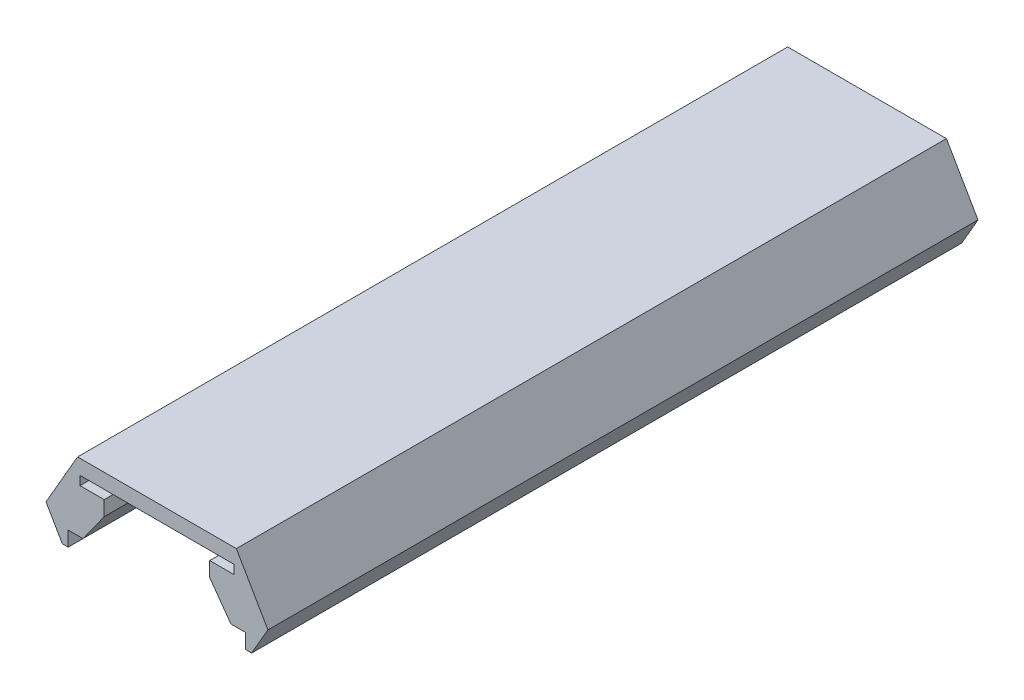
ISO-10303-21;
HEADER;
FILE_DESCRIPTION(('STEP AP214'),'2;1');
FILE_NAME('part.step','',(''),(''),'','','');
FILE_SCHEMA(('AUTOMOTIVE_DESIGN { 1 0 10303 214 1 1 1 1 }'));
ENDSEC;
DATA;
#1=APPLICATION_CONTEXT('core data for automotive mechanical design processes');
#2=APPLICATION_PROTOCOL_DEFINITION('international standard','automotive_design',2000,#1);
#3=PRODUCT_CONTEXT('',#1,'mechanical');
#4=PRODUCT('Part','Part','',(#3));
#5=PRODUCT_RELATED_PRODUCT_CATEGORY('part','',(#4));
#6=PRODUCT_DEFINITION_FORMATION('','',#4);
#7=PRODUCT_DEFINITION_CONTEXT('part definition',#1,'design');
#8=PRODUCT_DEFINITION('design','',#6,#7);
#9=PRODUCT_DEFINITION_SHAPE('','',#8);
#10=(LENGTH_UNIT() NAMED_UNIT(*) SI_UNIT(.MILLI.,.METRE.));
#11=(NAMED_UNIT(*) PLANE_ANGLE_UNIT() SI_UNIT($,.RADIAN.));
#12=(NAMED_UNIT(*) SI_UNIT($,.STERADIAN.) SOLID_ANGLE_UNIT());
#13=UNCERTAINTY_MEASURE_WITH_UNIT(LENGTH_MEASURE(1.E-05),#10,'distance_accuracy_value','');
#14=(GEOMETRIC_REPRESENTATION_CONTEXT(3) GLOBAL_UNCERTAINTY_ASSIGNED_CONTEXT((#13)) GLOBAL_UNIT_ASSIGNED_CONTEXT((#10,
#11,#12)) REPRESENTATION_CONTEXT('',''));
#15=CARTESIAN_POINT('',(0.,0.,0.));
#16=DIRECTION('',(0.,0.,1.));
#17=DIRECTION('',(1.,0.,0.));
#18=AXIS2_PLACEMENT_3D('',#15,#16,#17);
#19=CARTESIAN_POINT('',(5.36683849253808,1.,24.));
#20=DIRECTION('',(0.,-1.,0.));
#21=DIRECTION('',(0.,0.,-1.));
#22=AXIS2_PLACEMENT_3D('',#19,#20,#21);
#23=PLANE('',#22);
#24=DIRECTION('',(-1.,0.,0.));
#25=VECTOR('',#24,1.);
#26=CARTESIAN_POINT('',(5.36683849253808,1.,-24.));
#27=LINE('',#26,#25);
#28=CARTESIAN_POINT('',(5.36683849253808,1.,-24.));
#29=VERTEX_POINT('',#28);
#30=CARTESIAN_POINT('',(-5.36683849253808,1.,-24.));
#31=VERTEX_POINT('',#30);
#32=EDGE_CURVE('E203',#29,#31,#27,.T.);
#33=ORIENTED_EDGE('',*,*,#32,.T.);
#34=DIRECTION('',(0.,0.,-1.));
#35=VECTOR('',#34,1.);
#36=CARTESIAN_POINT('',(-5.36683849253808,1.,24.));
#37=LINE('',#36,#35);
#38=CARTESIAN_POINT('',(-5.36683849253808,1.,24.));
#39=VERTEX_POINT('',#38);
#40=EDGE_CURVE('E11',#39,#31,#37,.T.);
#41=ORIENTED_EDGE('',*,*,#40,.F.);
#42=DIRECTION('',(-1.,0.,0.));
#43=VECTOR('',#42,1.);
#44=CARTESIAN_POINT('',(5.36683849253808,1.,24.));
#45=LINE('',#44,#43);
#46=CARTESIAN_POINT('',(5.36683849253808,1.,24.));
#47=VERTEX_POINT('',#46);
#48=EDGE_CURVE('E241',#47,#39,#45,.T.);
#49=ORIENTED_EDGE('',*,*,#48,.F.);
#50=DIRECTION('',(0.,0.,-1.));
#51=VECTOR('',#50,1.);
#52=CARTESIAN_POINT('',(5.36683849253808,1.,24.));
#53=LINE('',#52,#51);
#54=EDGE_CURVE('E199',#47,#29,#53,.T.);
#55=ORIENTED_EDGE('',*,*,#54,.T.);
#56=EDGE_LOOP('',(#33,#41,#49,#55));
#57=FACE_BOUND('',#56,.T.);
#58=ADVANCED_FACE('F35',(#57),#23,.F.);
#59=CARTESIAN_POINT('',(-5.36683849253808,1.,24.));
#60=DIRECTION('',(0.866025403784437,-0.500000000000004,0.));
#61=DIRECTION('',(0.500000000000004,0.866025403784437,0.));
#62=AXIS2_PLACEMENT_3D('',#59,#60,#61);
#63=PLANE('',#62);
#64=DIRECTION('',(-0.500000000000004,-0.866025403784436,0.));
#65=VECTOR('',#64,1.);
#66=CARTESIAN_POINT('',(-5.36683849253808,1.,-24.));
#67=LINE('',#66,#65);
#68=CARTESIAN_POINT('',(-7.5,-2.69474411167423,-24.));
#69=VERTEX_POINT('',#68);
#70=EDGE_CURVE('E206',#31,#69,#67,.T.);
#71=ORIENTED_EDGE('',*,*,#70,.T.);
#72=DIRECTION('',(0.,0.,-1.));
#73=VECTOR('',#72,1.);
#74=CARTESIAN_POINT('',(-7.5,-2.69474411167423,24.));
#75=LINE('',#74,#73);
#76=CARTESIAN_POINT('',(-7.5,-2.69474411167423,24.));
#77=VERTEX_POINT('',#76);
#78=EDGE_CURVE('E43',#77,#69,#75,.T.);
#79=ORIENTED_EDGE('',*,*,#78,.F.);
#80=DIRECTION('',(-0.500000000000004,-0.866025403784436,0.));
#81=VECTOR('',#80,1.);
#82=CARTESIAN_POINT('',(-5.36683849253808,1.,24.));
#83=LINE('',#82,#81);
#84=EDGE_CURVE('E130',#39,#77,#83,.T.);
#85=ORIENTED_EDGE('',*,*,#84,.F.);
#86=ORIENTED_EDGE('',*,*,#40,.T.);
#87=EDGE_LOOP('',(#71,#79,#85,#86));
#88=FACE_BOUND('',#87,.T.);
#89=ADVANCED_FACE('F359',(#88),#63,.F.);
#90=CARTESIAN_POINT('',(-7.5,-2.69474411167423,24.));
#91=DIRECTION('',(0.86602540378444,0.499999999999998,0.));
#92=DIRECTION('',(-0.499999999999998,0.86602540378444,0.));
#93=AXIS2_PLACEMENT_3D('',#90,#91,#92);
#94=PLANE('',#93);
#95=DIRECTION('',(0.499999999999998,-0.86602540378444,0.));
#96=VECTOR('',#95,1.);
#97=CARTESIAN_POINT('',(-7.5,-2.69474411167423,-24.));
#98=LINE('',#97,#96);
#99=CARTESIAN_POINT('',(-6.4,-4.6,-24.));
#100=VERTEX_POINT('',#99);
#101=EDGE_CURVE('E208',#69,#100,#98,.T.);
#102=ORIENTED_EDGE('',*,*,#101,.T.);
#103=DIRECTION('',(0.,0.,-1.));
#104=VECTOR('',#103,1.);
#105=CARTESIAN_POINT('',(-6.4,-4.6,24.));
#106=LINE('',#105,#104);
#107=CARTESIAN_POINT('',(-6.4,-4.6,24.));
#108=VERTEX_POINT('',#107);
#109=EDGE_CURVE('E284',#108,#100,#106,.T.);
#110=ORIENTED_EDGE('',*,*,#109,.F.);
#111=DIRECTION('',(0.499999999999998,-0.86602540378444,0.));
#112=VECTOR('',#111,1.);
#113=CARTESIAN_POINT('',(-7.5,-2.69474411167423,24.));
#114=LINE('',#113,#112);
#115=EDGE_CURVE('E292',#77,#108,#114,.T.);
#116=ORIENTED_EDGE('',*,*,#115,.F.);
#117=ORIENTED_EDGE('',*,*,#78,.T.);
#118=EDGE_LOOP('',(#102,#110,#116,#117));
#119=FACE_BOUND('',#118,.T.);
#120=ADVANCED_FACE('F290',(#119),#94,.F.);
#121=CARTESIAN_POINT('',(-6.4,-4.6,24.));
#122=DIRECTION('',(0.,1.,0.));
#123=DIRECTION('',(0.,0.,1.));
#124=AXIS2_PLACEMENT_3D('',#121,#122,#123);
#125=PLANE('',#124);
#126=DIRECTION('',(1.,0.,0.));
#127=VECTOR('',#126,1.);
#128=CARTESIAN_POINT('',(-6.4,-4.6,-24.));
#129=LINE('',#128,#127);
#130=CARTESIAN_POINT('',(-6.,-4.6,-24.));
#131=VERTEX_POINT('',#130);
#132=EDGE_CURVE('E210',#100,#131,#129,.T.);
#133=ORIENTED_EDGE('',*,*,#132,.T.);
#134=DIRECTION('',(0.,0.,-1.));
#135=VECTOR('',#134,1.);
#136=CARTESIAN_POINT('',(-6.,-4.6,24.));
#137=LINE('',#136,#135);
#138=CARTESIAN_POINT('',(-6.,-4.6,24.));
#139=VERTEX_POINT('',#138);
#140=EDGE_CURVE('E281',#139,#131,#137,.T.);
#141=ORIENTED_EDGE('',*,*,#140,.F.);
#142=DIRECTION('',(1.,0.,0.));
#143=VECTOR('',#142,1.);
#144=CARTESIAN_POINT('',(-6.4,-4.6,24.));
#145=LINE('',#144,#143);
#146=EDGE_CURVE('E310',#108,#139,#145,.T.);
#147=ORIENTED_EDGE('',*,*,#146,.F.);
#148=ORIENTED_EDGE('',*,*,#109,.T.);
#149=EDGE_LOOP('',(#133,#141,#147,#148));
#150=FACE_BOUND('',#149,.T.);
#151=ADVANCED_FACE('F301',(#150),#125,.F.);
#152=CARTESIAN_POINT('',(-6.,-4.6,24.));
#153=DIRECTION('',(-1.,0.,0.));
#154=DIRECTION('',(0.,0.,1.));
#155=AXIS2_PLACEMENT_3D('',#152,#153,#154);
#156=PLANE('',#155);
#157=DIRECTION('',(0.,1.,0.));
#158=VECTOR('',#157,1.);
#159=CARTESIAN_POINT('',(-6.,-4.6,-24.));
#160=LINE('',#159,#158);
#161=CARTESIAN_POINT('',(-6.,-3.6,-24.));
#162=VERTEX_POINT('',#161);
#163=EDGE_CURVE('E212',#131,#162,#160,.T.);
#164=ORIENTED_EDGE('',*,*,#163,.T.);
#165=DIRECTION('',(0.,0.,-1.));
#166=VECTOR('',#165,1.);
#167=CARTESIAN_POINT('',(-6.,-3.6,24.));
#168=LINE('',#167,#166);
#169=CARTESIAN_POINT('',(-6.,-3.6,24.));
#170=VERTEX_POINT('',#169);
#171=EDGE_CURVE('E278',#170,#162,#168,.T.);
#172=ORIENTED_EDGE('',*,*,#171,.F.);
#173=DIRECTION('',(0.,1.,0.));
#174=VECTOR('',#173,1.);
#175=CARTESIAN_POINT('',(-6.,-4.6,24.));
#176=LINE('',#175,#174);
#177=EDGE_CURVE('E307',#139,#170,#176,.T.);
#178=ORIENTED_EDGE('',*,*,#177,.F.);
#179=ORIENTED_EDGE('',*,*,#140,.T.);
#180=EDGE_LOOP('',(#164,#172,#178,#179));
#181=FACE_BOUND('',#180,.T.);
#182=ADVANCED_FACE('F305',(#181),#156,.F.);
#183=CARTESIAN_POINT('',(-6.,-3.6,24.));
#184=DIRECTION('',(0.,1.,0.));
#185=DIRECTION('',(0.,0.,1.));
#186=AXIS2_PLACEMENT_3D('',#183,#184,#185);
#187=PLANE('',#186);
#188=DIRECTION('',(1.,0.,0.));
#189=VECTOR('',#188,1.);
#190=CARTESIAN_POINT('',(-6.,-3.6,-24.));
#191=LINE('',#190,#189);
#192=CARTESIAN_POINT('',(-5.,-3.6,-24.));
#193=VERTEX_POINT('',#192);
#194=EDGE_CURVE('E214',#162,#193,#191,.T.);
#195=ORIENTED_EDGE('',*,*,#194,.T.);
#196=DIRECTION('',(0.,0.,-1.));
#197=VECTOR('',#196,1.);
#198=CARTESIAN_POINT('',(-5.,-3.6,24.));
#199=LINE('',#198,#197);
#200=CARTESIAN_POINT('',(-5.,-3.6,24.));
#201=VERTEX_POINT('',#200);
#202=EDGE_CURVE('E275',#201,#193,#199,.T.);
#203=ORIENTED_EDGE('',*,*,#202,.F.);
#204=DIRECTION('',(1.,0.,0.));
#205=VECTOR('',#204,1.);
#206=CARTESIAN_POINT('',(-6.,-3.6,24.));
#207=LINE('',#206,#205);
#208=EDGE_CURVE('E309',#170,#201,#207,.T.);
#209=ORIENTED_EDGE('',*,*,#208,.F.);
#210=ORIENTED_EDGE('',*,*,#171,.T.);
#211=EDGE_LOOP('',(#195,#203,#209,#210));
#212=FACE_BOUND('',#211,.T.);
#213=ADVANCED_FACE('F372',(#212),#187,.F.);
#214=CARTESIAN_POINT('',(-5.,-3.6,24.));
#215=DIRECTION('',(-0.812867597931049,0.582448511229796,0.));
#216=DIRECTION('',(-0.582448511229796,-0.812867597931049,0.));
#217=AXIS2_PLACEMENT_3D('',#214,#215,#216);
#218=PLANE('',#217);
#219=DIRECTION('',(0.582448511229796,0.812867597931049,0.));
#220=VECTOR('',#219,1.);
#221=CARTESIAN_POINT('',(-5.,-3.6,-24.));
#222=LINE('',#221,#220);
#223=CARTESIAN_POINT('',(-3.56692894953059,-1.6,-24.));
#224=VERTEX_POINT('',#223);
#225=EDGE_CURVE('E216',#193,#224,#222,.T.);
#226=ORIENTED_EDGE('',*,*,#225,.T.);
#227=DIRECTION('',(0.,0.,-1.));
#228=VECTOR('',#227,1.);
#229=CARTESIAN_POINT('',(-3.56692894953059,-1.6,24.));
#230=LINE('',#229,#228);
#231=CARTESIAN_POINT('',(-3.56692894953059,-1.6,24.));
#232=VERTEX_POINT('',#231);
#233=EDGE_CURVE('E272',#232,#224,#230,.T.);
#234=ORIENTED_EDGE('',*,*,#233,.F.);
#235=DIRECTION('',(0.582448511229796,0.812867597931049,0.));
#236=VECTOR('',#235,1.);
#237=CARTESIAN_POINT('',(-5.,-3.6,24.));
#238=LINE('',#237,#236);
#239=EDGE_CURVE('E312',#201,#232,#238,.T.);
#240=ORIENTED_EDGE('',*,*,#239,.F.);
#241=ORIENTED_EDGE('',*,*,#202,.T.);
#242=EDGE_LOOP('',(#226,#234,#240,#241));
#243=FACE_BOUND('',#242,.T.);
#244=ADVANCED_FACE('F375',(#243),#218,.F.);
#245=CARTESIAN_POINT('',(-3.56692894953059,-1.6,24.));
#246=DIRECTION('',(-1.,0.,0.));
#247=DIRECTION('',(0.,0.,1.));
#248=AXIS2_PLACEMENT_3D('',#245,#246,#247);
#249=PLANE('',#248);
#250=DIRECTION('',(0.,1.,0.));
#251=VECTOR('',#250,1.);
#252=CARTESIAN_POINT('',(-3.56692894953059,-1.6,-24.));
#253=LINE('',#252,#251);
#254=CARTESIAN_POINT('',(-3.56692894953059,-0.6,-24.));
#255=VERTEX_POINT('',#254);
#256=EDGE_CURVE('E218',#224,#255,#253,.T.);
#257=ORIENTED_EDGE('',*,*,#256,.T.);
#258=DIRECTION('',(0.,0.,-1.));
#259=VECTOR('',#258,1.);
#260=CARTESIAN_POINT('',(-3.56692894953059,-0.6,24.));
#261=LINE('',#260,#259);
#262=CARTESIAN_POINT('',(-3.56692894953059,-0.6,24.));
#263=VERTEX_POINT('',#262);
#264=EDGE_CURVE('E269',#263,#255,#261,.T.);
#265=ORIENTED_EDGE('',*,*,#264,.F.);
#266=DIRECTION('',(0.,1.,0.));
#267=VECTOR('',#266,1.);
#268=CARTESIAN_POINT('',(-3.56692894953059,-1.6,24.));
#269=LINE('',#268,#267);
#270=EDGE_CURVE('E318',#232,#263,#269,.T.);
#271=ORIENTED_EDGE('',*,*,#270,.F.);
#272=ORIENTED_EDGE('',*,*,#233,.T.);
#273=EDGE_LOOP('',(#257,#265,#271,#272));
#274=FACE_BOUND('',#273,.T.);
#275=ADVANCED_FACE('F379',(#274),#249,.F.);
#276=CARTESIAN_POINT('',(-3.56692894953059,-0.6,24.));
#277=DIRECTION('',(0.,-1.,0.));
#278=DIRECTION('',(0.,0.,-1.));
#279=AXIS2_PLACEMENT_3D('',#276,#277,#278);
#280=PLANE('',#279);
#281=DIRECTION('',(-1.,0.,0.));
#282=VECTOR('',#281,1.);
#283=CARTESIAN_POINT('',(-3.56692894953059,-0.6,-24.));
#284=LINE('',#283,#282);
#285=CARTESIAN_POINT('',(-5.2,-0.6,-24.));
#286=VERTEX_POINT('',#285);
#287=EDGE_CURVE('E220',#255,#286,#284,.T.);
#288=ORIENTED_EDGE('',*,*,#287,.T.);
#289=DIRECTION('',(0.,0.,-1.));
#290=VECTOR('',#289,1.);
#291=CARTESIAN_POINT('',(-5.2,-0.6,24.));
#292=LINE('',#291,#290);
#293=CARTESIAN_POINT('',(-5.2,-0.6,24.));
#294=VERTEX_POINT('',#293);
#295=EDGE_CURVE('E266',#294,#286,#292,.T.);
#296=ORIENTED_EDGE('',*,*,#295,.F.);
#297=DIRECTION('',(-1.,0.,0.));
#298=VECTOR('',#297,1.);
#299=CARTESIAN_POINT('',(-3.56692894953059,-0.6,24.));
#300=LINE('',#299,#298);
#301=EDGE_CURVE('E320',#263,#294,#300,.T.);
#302=ORIENTED_EDGE('',*,*,#301,.F.);
#303=ORIENTED_EDGE('',*,*,#264,.T.);
#304=EDGE_LOOP('',(#288,#296,#302,#303));
#305=FACE_BOUND('',#304,.T.);
#306=ADVANCED_FACE('F383',(#305),#280,.F.);
#307=CARTESIAN_POINT('',(-5.2,-0.6,24.));
#308=DIRECTION('',(-1.,0.,0.));
#309=DIRECTION('',(0.,0.,1.));
#310=AXIS2_PLACEMENT_3D('',#307,#308,#309);
#311=PLANE('',#310);
#312=DIRECTION('',(0.,1.,0.));
#313=VECTOR('',#312,1.);
#314=CARTESIAN_POINT('',(-5.2,-0.6,-24.));
#315=LINE('',#314,#313);
#316=CARTESIAN_POINT('',(-5.2,0.,-24.));
#317=VERTEX_POINT('',#316);
#318=EDGE_CURVE('E222',#286,#317,#315,.T.);
#319=ORIENTED_EDGE('',*,*,#318,.T.);
#320=DIRECTION('',(0.,0.,-1.));
#321=VECTOR('',#320,1.);
#322=CARTESIAN_POINT('',(-5.2,0.,24.));
#323=LINE('',#322,#321);
#324=CARTESIAN_POINT('',(-5.2,0.,24.));
#325=VERTEX_POINT('',#324);
#326=EDGE_CURVE('E263',#325,#317,#323,.T.);
#327=ORIENTED_EDGE('',*,*,#326,.F.);
#328=DIRECTION('',(0.,1.,0.));
#329=VECTOR('',#328,1.);
#330=CARTESIAN_POINT('',(-5.2,-0.6,24.));
#331=LINE('',#330,#329);
#332=EDGE_CURVE('E322',#294,#325,#331,.T.);
#333=ORIENTED_EDGE('',*,*,#332,.F.);
#334=ORIENTED_EDGE('',*,*,#295,.T.);
#335=EDGE_LOOP('',(#319,#327,#333,#334));
#336=FACE_BOUND('',#335,.T.);
#337=ADVANCED_FACE('F387',(#336),#311,.F.);
#338=CARTESIAN_POINT('',(-5.2,0.,24.));
#339=DIRECTION('',(0.,1.,0.));
#340=DIRECTION('',(0.,0.,1.));
#341=AXIS2_PLACEMENT_3D('',#338,#339,#340);
#342=PLANE('',#341);
#343=DIRECTION('',(1.,0.,0.));
#344=VECTOR('',#343,1.);
#345=CARTESIAN_POINT('',(-5.2,0.,-24.));
#346=LINE('',#345,#344);
#347=CARTESIAN_POINT('',(5.2,0.,-24.));
#348=VERTEX_POINT('',#347);
#349=EDGE_CURVE('E224',#317,#348,#346,.T.);
#350=ORIENTED_EDGE('',*,*,#349,.T.);
#351=DIRECTION('',(0.,0.,-1.));
#352=VECTOR('',#351,1.);
#353=CARTESIAN_POINT('',(5.2,0.,24.));
#354=LINE('',#353,#352);
#355=CARTESIAN_POINT('',(5.2,0.,24.));
#356=VERTEX_POINT('',#355);
#357=EDGE_CURVE('E260',#356,#348,#354,.T.);
#358=ORIENTED_EDGE('',*,*,#357,.F.);
#359=DIRECTION('',(1.,0.,0.));
#360=VECTOR('',#359,1.);
#361=CARTESIAN_POINT('',(-5.2,0.,24.));
#362=LINE('',#361,#360);
#363=EDGE_CURVE('E324',#325,#356,#362,.T.);
#364=ORIENTED_EDGE('',*,*,#363,.F.);
#365=ORIENTED_EDGE('',*,*,#326,.T.);
#366=EDGE_LOOP('',(#350,#358,#364,#365));
#367=FACE_BOUND('',#366,.T.);
#368=ADVANCED_FACE('F391',(#367),#342,.F.);
#369=CARTESIAN_POINT('',(5.2,0.,24.));
#370=DIRECTION('',(1.,0.,0.));
#371=DIRECTION('',(0.,0.,-1.));
#372=AXIS2_PLACEMENT_3D('',#369,#370,#371);
#373=PLANE('',#372);
#374=DIRECTION('',(0.,-1.,0.));
#375=VECTOR('',#374,1.);
#376=CARTESIAN_POINT('',(5.2,0.,-24.));
#377=LINE('',#376,#375);
#378=CARTESIAN_POINT('',(5.2,-0.6,-24.));
#379=VERTEX_POINT('',#378);
#380=EDGE_CURVE('E226',#348,#379,#377,.T.);
#381=ORIENTED_EDGE('',*,*,#380,.T.);
#382=DIRECTION('',(0.,0.,-1.));
#383=VECTOR('',#382,1.);
#384=CARTESIAN_POINT('',(5.2,-0.6,24.));
#385=LINE('',#384,#383);
#386=CARTESIAN_POINT('',(5.2,-0.6,24.));
#387=VERTEX_POINT('',#386);
#388=EDGE_CURVE('E257',#387,#379,#385,.T.);
#389=ORIENTED_EDGE('',*,*,#388,.F.);
#390=DIRECTION('',(0.,-1.,0.));
#391=VECTOR('',#390,1.);
#392=CARTESIAN_POINT('',(5.2,0.,24.));
#393=LINE('',#392,#391);
#394=EDGE_CURVE('E326',#356,#387,#393,.T.);
#395=ORIENTED_EDGE('',*,*,#394,.F.);
#396=ORIENTED_EDGE('',*,*,#357,.T.);
#397=EDGE_LOOP('',(#381,#389,#395,#396));
#398=FACE_BOUND('',#397,.T.);
#399=ADVANCED_FACE('F395',(#398),#373,.F.);
#400=CARTESIAN_POINT('',(5.2,-0.6,24.));
#401=DIRECTION('',(0.,-1.,0.));
#402=DIRECTION('',(0.,0.,-1.));
#403=AXIS2_PLACEMENT_3D('',#400,#401,#402);
#404=PLANE('',#403);
#405=DIRECTION('',(-1.,0.,0.));
#406=VECTOR('',#405,1.);
#407=CARTESIAN_POINT('',(5.2,-0.6,-24.));
#408=LINE('',#407,#406);
#409=CARTESIAN_POINT('',(3.56692894953059,-0.6,-24.));
#410=VERTEX_POINT('',#409);
#411=EDGE_CURVE('E228',#379,#410,#408,.T.);
#412=ORIENTED_EDGE('',*,*,#411,.T.);
#413=DIRECTION('',(0.,0.,-1.));
#414=VECTOR('',#413,1.);
#415=CARTESIAN_POINT('',(3.56692894953059,-0.6,24.));
#416=LINE('',#415,#414);
#417=CARTESIAN_POINT('',(3.56692894953059,-0.6,24.));
#418=VERTEX_POINT('',#417);
#419=EDGE_CURVE('E254',#418,#410,#416,.T.);
#420=ORIENTED_EDGE('',*,*,#419,.F.);
#421=DIRECTION('',(-1.,0.,0.));
#422=VECTOR('',#421,1.);
#423=CARTESIAN_POINT('',(5.2,-0.6,24.));
#424=LINE('',#423,#422);
#425=EDGE_CURVE('E328',#387,#418,#424,.T.);
#426=ORIENTED_EDGE('',*,*,#425,.F.);
#427=ORIENTED_EDGE('',*,*,#388,.T.);
#428=EDGE_LOOP('',(#412,#420,#426,#427));
#429=FACE_BOUND('',#428,.T.);
#430=ADVANCED_FACE('F399',(#429),#404,.F.);
#431=CARTESIAN_POINT('',(3.56692894953059,-0.6,24.));
#432=DIRECTION('',(1.,0.,0.));
#433=DIRECTION('',(0.,0.,-1.));
#434=AXIS2_PLACEMENT_3D('',#431,#432,#433);
#435=PLANE('',#434);
#436=DIRECTION('',(0.,-1.,0.));
#437=VECTOR('',#436,1.);
#438=CARTESIAN_POINT('',(3.56692894953059,-0.6,-24.));
#439=LINE('',#438,#437);
#440=CARTESIAN_POINT('',(3.56692894953059,-1.6,-24.));
#441=VERTEX_POINT('',#440);
#442=EDGE_CURVE('E230',#410,#441,#439,.T.);
#443=ORIENTED_EDGE('',*,*,#442,.T.);
#444=DIRECTION('',(0.,0.,-1.));
#445=VECTOR('',#444,1.);
#446=CARTESIAN_POINT('',(3.56692894953059,-1.6,24.));
#447=LINE('',#446,#445);
#448=CARTESIAN_POINT('',(3.56692894953059,-1.6,24.));
#449=VERTEX_POINT('',#448);
#450=EDGE_CURVE('E251',#449,#441,#447,.T.);
#451=ORIENTED_EDGE('',*,*,#450,.F.);
#452=DIRECTION('',(0.,-1.,0.));
#453=VECTOR('',#452,1.);
#454=CARTESIAN_POINT('',(3.56692894953059,-0.6,24.));
#455=LINE('',#454,#453);
#456=EDGE_CURVE('E330',#418,#449,#455,.T.);
#457=ORIENTED_EDGE('',*,*,#456,.F.);
#458=ORIENTED_EDGE('',*,*,#419,.T.);
#459=EDGE_LOOP('',(#443,#451,#457,#458));
#460=FACE_BOUND('',#459,.T.);
#461=ADVANCED_FACE('F403',(#460),#435,.F.);
#462=CARTESIAN_POINT('',(3.56692894953059,-1.6,24.));
#463=DIRECTION('',(0.812867597931049,0.582448511229796,0.));
#464=DIRECTION('',(-0.582448511229796,0.812867597931049,0.));
#465=AXIS2_PLACEMENT_3D('',#462,#463,#464);
#466=PLANE('',#465);
#467=DIRECTION('',(0.582448511229796,-0.812867597931049,0.));
#468=VECTOR('',#467,1.);
#469=CARTESIAN_POINT('',(3.56692894953059,-1.6,-24.));
#470=LINE('',#469,#468);
#471=CARTESIAN_POINT('',(5.,-3.6,-24.));
#472=VERTEX_POINT('',#471);
#473=EDGE_CURVE('E232',#441,#472,#470,.T.);
#474=ORIENTED_EDGE('',*,*,#473,.T.);
#475=DIRECTION('',(0.,0.,-1.));
#476=VECTOR('',#475,1.);
#477=CARTESIAN_POINT('',(5.,-3.6,24.));
#478=LINE('',#477,#476);
#479=CARTESIAN_POINT('',(5.,-3.6,24.));
#480=VERTEX_POINT('',#479);
#481=EDGE_CURVE('E248',#480,#472,#478,.T.);
#482=ORIENTED_EDGE('',*,*,#481,.F.);
#483=DIRECTION('',(0.582448511229796,-0.812867597931049,0.));
#484=VECTOR('',#483,1.);
#485=CARTESIAN_POINT('',(3.56692894953059,-1.6,24.));
#486=LINE('',#485,#484);
#487=EDGE_CURVE('E332',#449,#480,#486,.T.);
#488=ORIENTED_EDGE('',*,*,#487,.F.);
#489=ORIENTED_EDGE('',*,*,#450,.T.);
#490=EDGE_LOOP('',(#474,#482,#488,#489));
#491=FACE_BOUND('',#490,.T.);
#492=ADVANCED_FACE('F407',(#491),#466,.F.);
#493=CARTESIAN_POINT('',(5.,-3.6,24.));
#494=DIRECTION('',(0.,1.,0.));
#495=DIRECTION('',(0.,0.,1.));
#496=AXIS2_PLACEMENT_3D('',#493,#494,#495);
#497=PLANE('',#496);
#498=DIRECTION('',(1.,0.,0.));
#499=VECTOR('',#498,1.);
#500=CARTESIAN_POINT('',(5.,-3.6,-24.));
#501=LINE('',#500,#499);
#502=CARTESIAN_POINT('',(6.,-3.6,-24.));
#503=VERTEX_POINT('',#502);
#504=EDGE_CURVE('E234',#472,#503,#501,.T.);
#505=ORIENTED_EDGE('',*,*,#504,.T.);
#506=DIRECTION('',(0.,0.,-1.));
#507=VECTOR('',#506,1.);
#508=CARTESIAN_POINT('',(6.,-3.6,24.));
#509=LINE('',#508,#507);
#510=CARTESIAN_POINT('',(6.,-3.6,24.));
#511=VERTEX_POINT('',#510);
#512=EDGE_CURVE('E245',#511,#503,#509,.T.);
#513=ORIENTED_EDGE('',*,*,#512,.F.);
#514=DIRECTION('',(1.,0.,0.));
#515=VECTOR('',#514,1.);
#516=CARTESIAN_POINT('',(5.,-3.6,24.));
#517=LINE('',#516,#515);
#518=EDGE_CURVE('E334',#480,#511,#517,.T.);
#519=ORIENTED_EDGE('',*,*,#518,.F.);
#520=ORIENTED_EDGE('',*,*,#481,.T.);
#521=EDGE_LOOP('',(#505,#513,#519,#520));
#522=FACE_BOUND('',#521,.T.);
#523=ADVANCED_FACE('F340',(#522),#497,.F.);
#524=CARTESIAN_POINT('',(6.,-3.6,24.));
#525=DIRECTION('',(1.,0.,0.));
#526=DIRECTION('',(0.,0.,-1.));
#527=AXIS2_PLACEMENT_3D('',#524,#525,#526);
#528=PLANE('',#527);
#529=DIRECTION('',(0.,-1.,0.));
#530=VECTOR('',#529,1.);
#531=CARTESIAN_POINT('',(6.,-3.6,-24.));
#532=LINE('',#531,#530);
#533=CARTESIAN_POINT('',(6.,-4.6,-24.));
#534=VERTEX_POINT('',#533);
#535=EDGE_CURVE('E236',#503,#534,#532,.T.);
#536=ORIENTED_EDGE('',*,*,#535,.T.);
#537=DIRECTION('',(0.,0.,-1.));
#538=VECTOR('',#537,1.);
#539=CARTESIAN_POINT('',(6.,-4.6,24.));
#540=LINE('',#539,#538);
#541=CARTESIAN_POINT('',(6.,-4.6,24.));
#542=VERTEX_POINT('',#541);
#543=EDGE_CURVE('E194',#542,#534,#540,.T.);
#544=ORIENTED_EDGE('',*,*,#543,.F.);
#545=DIRECTION('',(0.,-1.,0.));
#546=VECTOR('',#545,1.);
#547=CARTESIAN_POINT('',(6.,-3.6,24.));
#548=LINE('',#547,#546);
#549=EDGE_CURVE('E185',#511,#542,#548,.T.);
#550=ORIENTED_EDGE('',*,*,#549,.F.);
#551=ORIENTED_EDGE('',*,*,#512,.T.);
#552=EDGE_LOOP('',(#536,#544,#550,#551));
#553=FACE_BOUND('',#552,.T.);
#554=ADVANCED_FACE('F344',(#553),#528,.F.);
#555=CARTESIAN_POINT('',(6.,-4.6,24.));
#556=DIRECTION('',(0.,1.,0.));
#557=DIRECTION('',(0.,0.,1.));
#558=AXIS2_PLACEMENT_3D('',#555,#556,#557);
#559=PLANE('',#558);
#560=DIRECTION('',(1.,0.,0.));
#561=VECTOR('',#560,1.);
#562=CARTESIAN_POINT('',(6.,-4.6,-24.));
#563=LINE('',#562,#561);
#564=CARTESIAN_POINT('',(6.4,-4.6,-24.));
#565=VERTEX_POINT('',#564);
#566=EDGE_CURVE('E193',#534,#565,#563,.T.);
#567=ORIENTED_EDGE('',*,*,#566,.T.);
#568=DIRECTION('',(0.,0.,-1.));
#569=VECTOR('',#568,1.);
#570=CARTESIAN_POINT('',(6.4,-4.6,24.));
#571=LINE('',#570,#569);
#572=CARTESIAN_POINT('',(6.4,-4.6,24.));
#573=VERTEX_POINT('',#572);
#574=EDGE_CURVE('E190',#573,#565,#571,.T.);
#575=ORIENTED_EDGE('',*,*,#574,.F.);
#576=DIRECTION('',(1.,0.,0.));
#577=VECTOR('',#576,1.);
#578=CARTESIAN_POINT('',(6.,-4.6,24.));
#579=LINE('',#578,#577);
#580=EDGE_CURVE('E179',#542,#573,#579,.T.);
#581=ORIENTED_EDGE('',*,*,#580,.F.);
#582=ORIENTED_EDGE('',*,*,#543,.T.);
#583=EDGE_LOOP('',(#567,#575,#581,#582));
#584=FACE_BOUND('',#583,.T.);
#585=ADVANCED_FACE('F191',(#584),#559,.F.);
#586=CARTESIAN_POINT('',(6.4,-4.6,24.));
#587=DIRECTION('',(-0.86602540378444,0.499999999999998,0.));
#588=DIRECTION('',(-0.499999999999998,-0.86602540378444,0.));
#589=AXIS2_PLACEMENT_3D('',#586,#587,#588);
#590=PLANE('',#589);
#591=DIRECTION('',(0.499999999999998,0.86602540378444,0.));
#592=VECTOR('',#591,1.);
#593=CARTESIAN_POINT('',(6.4,-4.6,-24.));
#594=LINE('',#593,#592);
#595=CARTESIAN_POINT('',(7.5,-2.69474411167423,-24.));
#596=VERTEX_POINT('',#595);
#597=EDGE_CURVE('E116',#565,#596,#594,.T.);
#598=ORIENTED_EDGE('',*,*,#597,.T.);
#599=DIRECTION('',(0.,0.,-1.));
#600=VECTOR('',#599,1.);
#601=CARTESIAN_POINT('',(7.5,-2.69474411167423,24.));
#602=LINE('',#601,#600);
#603=CARTESIAN_POINT('',(7.5,-2.69474411167423,24.));
#604=VERTEX_POINT('',#603);
#605=EDGE_CURVE('E195',#604,#596,#602,.T.);
#606=ORIENTED_EDGE('',*,*,#605,.F.);
#607=DIRECTION('',(0.499999999999998,0.86602540378444,0.));
#608=VECTOR('',#607,1.);
#609=CARTESIAN_POINT('',(6.4,-4.6,24.));
#610=LINE('',#609,#608);
#611=EDGE_CURVE('E183',#573,#604,#610,.T.);
#612=ORIENTED_EDGE('',*,*,#611,.F.);
#613=ORIENTED_EDGE('',*,*,#574,.T.);
#614=EDGE_LOOP('',(#598,#606,#612,#613));
#615=FACE_BOUND('',#614,.T.);
#616=ADVANCED_FACE('F197',(#615),#590,.F.);
#617=CARTESIAN_POINT('',(7.5,-2.69474411167423,24.));
#618=DIRECTION('',(-0.866025403784437,-0.500000000000004,0.));
#619=DIRECTION('',(0.500000000000004,-0.866025403784437,0.));
#620=AXIS2_PLACEMENT_3D('',#617,#618,#619);
#621=PLANE('',#620);
#622=DIRECTION('',(-0.500000000000004,0.866025403784436,0.));
#623=VECTOR('',#622,1.);
#624=CARTESIAN_POINT('',(7.5,-2.69474411167423,-24.));
#625=LINE('',#624,#623);
#626=EDGE_CURVE('E122',#596,#29,#625,.T.);
#627=ORIENTED_EDGE('',*,*,#626,.T.);
#628=ORIENTED_EDGE('',*,*,#54,.F.);
#629=DIRECTION('',(-0.500000000000004,0.866025403784436,0.));
#630=VECTOR('',#629,1.);
#631=CARTESIAN_POINT('',(7.5,-2.69474411167423,24.));
#632=LINE('',#631,#630);
#633=EDGE_CURVE('E51',#604,#47,#632,.T.);
#634=ORIENTED_EDGE('',*,*,#633,.F.);
#635=ORIENTED_EDGE('',*,*,#605,.T.);
#636=EDGE_LOOP('',(#627,#628,#634,#635));
#637=FACE_BOUND('',#636,.T.);
#638=ADVANCED_FACE('F348',(#637),#621,.F.);
#639=CARTESIAN_POINT('',(0.,0.,24.));
#640=DIRECTION('',(0.,0.,-1.));
#641=DIRECTION('',(-1.,0.,0.));
#642=AXIS2_PLACEMENT_3D('',#639,#640,#641);
#643=PLANE('',#642);
#644=ORIENTED_EDGE('',*,*,#48,.T.);
#645=ORIENTED_EDGE('',*,*,#84,.T.);
#646=ORIENTED_EDGE('',*,*,#115,.T.);
#647=ORIENTED_EDGE('',*,*,#146,.T.);
#648=ORIENTED_EDGE('',*,*,#177,.T.);
#649=ORIENTED_EDGE('',*,*,#208,.T.);
#650=ORIENTED_EDGE('',*,*,#239,.T.);
#651=ORIENTED_EDGE('',*,*,#270,.T.);
#652=ORIENTED_EDGE('',*,*,#301,.T.);
#653=ORIENTED_EDGE('',*,*,#332,.T.);
#654=ORIENTED_EDGE('',*,*,#363,.T.);
#655=ORIENTED_EDGE('',*,*,#394,.T.);
#656=ORIENTED_EDGE('',*,*,#425,.T.);
#657=ORIENTED_EDGE('',*,*,#456,.T.);
#658=ORIENTED_EDGE('',*,*,#487,.T.);
#659=ORIENTED_EDGE('',*,*,#518,.T.);
#660=ORIENTED_EDGE('',*,*,#549,.T.);
#661=ORIENTED_EDGE('',*,*,#580,.T.);
#662=ORIENTED_EDGE('',*,*,#611,.T.);
#663=ORIENTED_EDGE('',*,*,#633,.T.);
#664=EDGE_LOOP('',(#644,#645,#646,#647,#648,#649,#650,#651,#652,#653,#654,#655,#656,#657,#658,
#659,#660,#661,#662,#663));
#665=FACE_BOUND('',#664,.T.);
#666=ADVANCED_FACE('F181',(#665),#643,.F.);
#667=CARTESIAN_POINT('',(0.,0.,-24.));
#668=DIRECTION('',(0.,0.,-1.));
#669=DIRECTION('',(-1.,0.,0.));
#670=AXIS2_PLACEMENT_3D('',#667,#668,#669);
#671=PLANE('',#670);
#672=ORIENTED_EDGE('',*,*,#32,.F.);
#673=ORIENTED_EDGE('',*,*,#626,.F.);
#674=ORIENTED_EDGE('',*,*,#597,.F.);
#675=ORIENTED_EDGE('',*,*,#566,.F.);
#676=ORIENTED_EDGE('',*,*,#535,.F.);
#677=ORIENTED_EDGE('',*,*,#504,.F.);
#678=ORIENTED_EDGE('',*,*,#473,.F.);
#679=ORIENTED_EDGE('',*,*,#442,.F.);
#680=ORIENTED_EDGE('',*,*,#411,.F.);
#681=ORIENTED_EDGE('',*,*,#380,.F.);
#682=ORIENTED_EDGE('',*,*,#349,.F.);
#683=ORIENTED_EDGE('',*,*,#318,.F.);
#684=ORIENTED_EDGE('',*,*,#287,.F.);
#685=ORIENTED_EDGE('',*,*,#256,.F.);
#686=ORIENTED_EDGE('',*,*,#225,.F.);
#687=ORIENTED_EDGE('',*,*,#194,.F.);
#688=ORIENTED_EDGE('',*,*,#163,.F.);
#689=ORIENTED_EDGE('',*,*,#132,.F.);
#690=ORIENTED_EDGE('',*,*,#101,.F.);
#691=ORIENTED_EDGE('',*,*,#70,.F.);
#692=EDGE_LOOP('',(#672,#673,#674,#675,#676,#677,#678,#679,#680,#681,#682,#683,#684,#685,#686,
#687,#688,#689,#690,#691));
#693=FACE_BOUND('',#692,.T.);
#694=ADVANCED_FACE('F296',(#693),#671,.T.);
#695=CLOSED_SHELL('',(#58,#89,#120,#151,#182,#213,#244,#275,#306,#337,#368,#399,#430,#461,#492,
#523,#554,#585,#616,#638,#666,#694));
#696=MANIFOLD_SOLID_BREP('B2',#695);
#697=ADVANCED_BREP_SHAPE_REPRESENTATION('',(#18,#696),#14);
#698=SHAPE_DEFINITION_REPRESENTATION(#9,#697);
ENDSEC;
END-ISO-10303-21;
